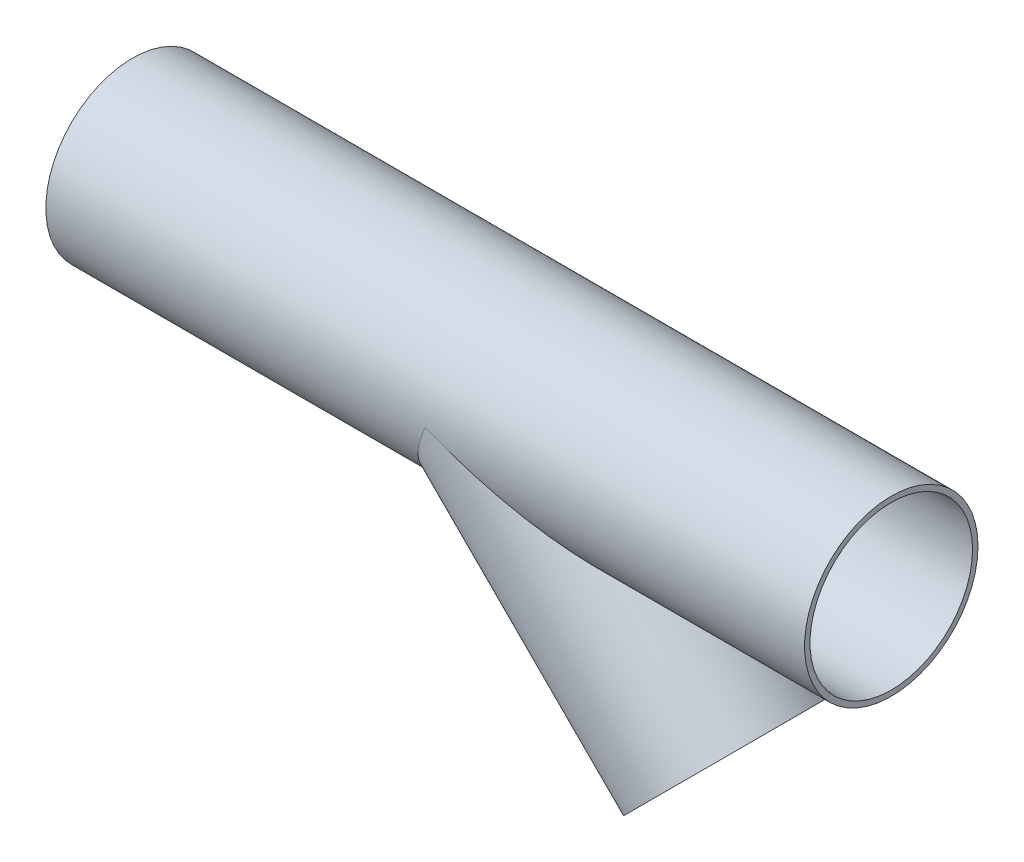
ISO-10303-21;
HEADER;
FILE_DESCRIPTION(('STEP AP214'),'2;1');
FILE_NAME('part.step','',(''),(''),'','','');
FILE_SCHEMA(('AUTOMOTIVE_DESIGN { 1 0 10303 214 1 1 1 1 }'));
ENDSEC;
DATA;
#1=APPLICATION_CONTEXT('core data for automotive mechanical design processes');
#2=APPLICATION_PROTOCOL_DEFINITION('international standard','automotive_design',2000,#1);
#3=PRODUCT_CONTEXT('',#1,'mechanical');
#4=PRODUCT('Part','Part','',(#3));
#5=PRODUCT_RELATED_PRODUCT_CATEGORY('part','',(#4));
#6=PRODUCT_DEFINITION_FORMATION('','',#4);
#7=PRODUCT_DEFINITION_CONTEXT('part definition',#1,'design');
#8=PRODUCT_DEFINITION('design','',#6,#7);
#9=PRODUCT_DEFINITION_SHAPE('','',#8);
#10=(LENGTH_UNIT() NAMED_UNIT(*) SI_UNIT(.MILLI.,.METRE.));
#11=(NAMED_UNIT(*) PLANE_ANGLE_UNIT() SI_UNIT($,.RADIAN.));
#12=(NAMED_UNIT(*) SI_UNIT($,.STERADIAN.) SOLID_ANGLE_UNIT());
#13=UNCERTAINTY_MEASURE_WITH_UNIT(LENGTH_MEASURE(1.E-05),#10,'distance_accuracy_value','');
#14=(GEOMETRIC_REPRESENTATION_CONTEXT(3) GLOBAL_UNCERTAINTY_ASSIGNED_CONTEXT((#13)) GLOBAL_UNIT_ASSIGNED_CONTEXT((#10,
#11,#12)) REPRESENTATION_CONTEXT('',''));
#15=CARTESIAN_POINT('',(0.,0.,0.));
#16=DIRECTION('',(0.,0.,1.));
#17=DIRECTION('',(1.,0.,0.));
#18=AXIS2_PLACEMENT_3D('',#15,#16,#17);
#19=CARTESIAN_POINT('',(250.,0.,-125.));
#20=DIRECTION('',(0.382683432365084,0.923879532511289,0.));
#21=DIRECTION('',(-0.923879532511289,0.382683432365084,0.));
#22=AXIS2_PLACEMENT_3D('',#19,#20,#21);
#23=PLANE('',#22);
#24=CARTESIAN_POINT('',(250.,0.,0.));
#25=DIRECTION('',(0.382683432365084,0.923879532511289,0.));
#26=DIRECTION('',(0.923879532511289,-0.382683432365084,0.));
#27=AXIS2_PLACEMENT_3D('',#24,#25,#26);
#28=ELLIPSE('',#27,140.978143910158,53.95);
#29=CARTESIAN_POINT('',(250.,0.,-53.95));
#30=VERTEX_POINT('',#29);
#31=CARTESIAN_POINT('',(250.,0.,53.95));
#32=VERTEX_POINT('',#31);
#33=EDGE_CURVE('E75',#30,#32,#28,.F.);
#34=ORIENTED_EDGE('',*,*,#33,.T.);
#35=DIRECTION('',(0.,0.,1.));
#36=VECTOR('',#35,1.);
#37=CARTESIAN_POINT('',(250.,0.,-125.));
#38=LINE('',#37,#36);
#39=CARTESIAN_POINT('',(250.,0.,57.15));
#40=VERTEX_POINT('',#39);
#41=EDGE_CURVE('E89',#32,#40,#38,.T.);
#42=ORIENTED_EDGE('',*,*,#41,.T.);
#43=CARTESIAN_POINT('',(250.,0.,0.));
#44=DIRECTION('',(0.382683432365084,0.923879532511289,0.));
#45=DIRECTION('',(0.923879532511289,-0.382683432365084,0.));
#46=AXIS2_PLACEMENT_3D('',#43,#44,#45);
#47=ELLIPSE('',#46,149.340146885367,57.15);
#48=CARTESIAN_POINT('',(250.,0.,-57.15));
#49=VERTEX_POINT('',#48);
#50=EDGE_CURVE('E85',#49,#40,#47,.F.);
#51=ORIENTED_EDGE('',*,*,#50,.F.);
#52=EDGE_CURVE('E62',#49,#30,#38,.T.);
#53=ORIENTED_EDGE('',*,*,#52,.T.);
#54=EDGE_LOOP('',(#34,#42,#51,#53));
#55=FACE_BOUND('',#54,.T.);
#56=ADVANCED_FACE('F58',(#55),#23,.T.);
#57=CARTESIAN_POINT('',(250.,0.,-125.));
#58=DIRECTION('',(-0.923879532511289,0.382683432365084,0.));
#59=DIRECTION('',(-0.382683432365084,-0.923879532511289,0.));
#60=AXIS2_PLACEMENT_3D('',#57,#58,#59);
#61=PLANE('',#60);
#62=CARTESIAN_POINT('',(250.,0.,0.));
#63=DIRECTION('',(-0.923879532511289,0.382683432365084,0.));
#64=DIRECTION('',(-0.382683432365084,-0.923879532511289,0.));
#65=AXIS2_PLACEMENT_3D('',#62,#63,#64);
#66=ELLIPSE('',#65,58.3950592057749,53.95);
#67=EDGE_CURVE('E96',#32,#30,#66,.F.);
#68=ORIENTED_EDGE('',*,*,#67,.T.);
#69=ORIENTED_EDGE('',*,*,#52,.F.);
#70=CARTESIAN_POINT('',(250.,0.,0.));
#71=DIRECTION('',(-0.923879532511289,0.382683432365084,0.));
#72=DIRECTION('',(-0.382683432365084,-0.923879532511289,0.));
#73=AXIS2_PLACEMENT_3D('',#70,#71,#72);
#74=ELLIPSE('',#73,61.8587142467106,57.15);
#75=EDGE_CURVE('E92',#40,#49,#74,.F.);
#76=ORIENTED_EDGE('',*,*,#75,.F.);
#77=ORIENTED_EDGE('',*,*,#41,.F.);
#78=EDGE_LOOP('',(#68,#69,#76,#77));
#79=FACE_BOUND('',#78,.T.);
#80=ADVANCED_FACE('F98',(#79),#61,.T.);
#81=CARTESIAN_POINT('',(393.542676580869,-143.542676580869,0.));
#82=DIRECTION('',(0.707106781186546,-0.707106781186549,0.));
#83=DIRECTION('',(0.707106781186549,0.707106781186546,0.));
#84=AXIS2_PLACEMENT_3D('',#81,#82,#83);
#85=PLANE('',#84);
#86=CARTESIAN_POINT('',(393.542676580869,-143.542676580869,0.));
#87=DIRECTION('',(0.707106781186546,-0.707106781186549,0.));
#88=DIRECTION('',(0.707106781186549,0.707106781186546,0.));
#89=AXIS2_PLACEMENT_3D('',#86,#87,#88);
#90=CIRCLE('',#89,53.95);
#91=CARTESIAN_POINT('',(431.691087425883,-105.394265735855,0.));
#92=VERTEX_POINT('',#91);
#93=EDGE_CURVE('E67',#92,#92,#90,.T.);
#94=ORIENTED_EDGE('',*,*,#93,.F.);
#95=EDGE_LOOP('',(#94));
#96=FACE_BOUND('',#95,.T.);
#97=CARTESIAN_POINT('',(393.542676580869,-143.542676580869,0.));
#98=DIRECTION('',(0.707106781186546,-0.707106781186549,0.));
#99=DIRECTION('',(0.707106781186549,0.707106781186546,0.));
#100=AXIS2_PLACEMENT_3D('',#97,#98,#99);
#101=CIRCLE('',#100,57.15);
#102=CARTESIAN_POINT('',(433.95382912568,-103.131524036058,0.));
#103=VERTEX_POINT('',#102);
#104=EDGE_CURVE('E13',#103,#103,#101,.T.);
#105=ORIENTED_EDGE('',*,*,#104,.T.);
#106=EDGE_LOOP('',(#105));
#107=FACE_BOUND('',#106,.T.);
#108=ADVANCED_FACE('F105',(#96,#107),#85,.T.);
#109=CARTESIAN_POINT('',(96.4235857864381,153.576414213562,0.));
#110=DIRECTION('',(0.707106781186546,-0.707106781186549,0.));
#111=DIRECTION('',(0.707106781186549,0.707106781186546,0.));
#112=AXIS2_PLACEMENT_3D('',#109,#110,#111);
#113=CYLINDRICAL_SURFACE('',#112,57.15);
#114=ORIENTED_EDGE('',*,*,#104,.F.);
#115=EDGE_LOOP('',(#114));
#116=FACE_BOUND('',#115,.T.);
#117=ORIENTED_EDGE('',*,*,#50,.T.);
#118=ORIENTED_EDGE('',*,*,#75,.T.);
#119=EDGE_LOOP('',(#117,#118));
#120=FACE_BOUND('',#119,.T.);
#121=ADVANCED_FACE('F94',(#116,#120),#113,.T.);
#122=CARTESIAN_POINT('',(96.4235857864381,153.576414213562,0.));
#123=DIRECTION('',(0.707106781186546,-0.707106781186549,0.));
#124=DIRECTION('',(0.707106781186549,0.707106781186546,0.));
#125=AXIS2_PLACEMENT_3D('',#122,#123,#124);
#126=CYLINDRICAL_SURFACE('',#125,53.95);
#127=ORIENTED_EDGE('',*,*,#93,.T.);
#128=EDGE_LOOP('',(#127));
#129=FACE_BOUND('',#128,.T.);
#130=ORIENTED_EDGE('',*,*,#67,.F.);
#131=ORIENTED_EDGE('',*,*,#33,.F.);
#132=EDGE_LOOP('',(#130,#131));
#133=FACE_BOUND('',#132,.T.);
#134=ADVANCED_FACE('F60',(#129,#133),#126,.F.);
#135=CLOSED_SHELL('',(#56,#80,#108,#121,#134));
#136=MANIFOLD_SOLID_BREP('B2',#135);
#137=CARTESIAN_POINT('',(500.,0.,0.));
#138=DIRECTION('',(-1.,0.,0.));
#139=DIRECTION('',(0.,0.,1.));
#140=AXIS2_PLACEMENT_3D('',#137,#138,#139);
#141=CYLINDRICAL_SURFACE('',#140,53.55);
#142=CARTESIAN_POINT('',(250.,0.,0.));
#143=DIRECTION('',(0.382683432365084,0.923879532511289,0.));
#144=DIRECTION('',(-0.923879532511289,0.382683432365084,0.));
#145=AXIS2_PLACEMENT_3D('',#142,#143,#144);
#146=ELLIPSE('',#145,139.932893538262,53.55);
#147=CARTESIAN_POINT('',(250.,0.,53.55));
#148=VERTEX_POINT('',#147);
#149=CARTESIAN_POINT('',(250.,0.,-53.55));
#150=VERTEX_POINT('',#149);
#151=EDGE_CURVE('E181',#148,#150,#146,.T.);
#152=ORIENTED_EDGE('',*,*,#151,.F.);
#153=CARTESIAN_POINT('',(250.,0.,0.));
#154=DIRECTION('',(-0.923879532511289,0.382683432365084,0.));
#155=DIRECTION('',(-0.382683432365084,-0.923879532511289,0.));
#156=AXIS2_PLACEMENT_3D('',#153,#154,#155);
#157=ELLIPSE('',#156,57.9621023256576,53.55);
#158=EDGE_CURVE('E183',#150,#148,#157,.T.);
#159=ORIENTED_EDGE('',*,*,#158,.F.);
#160=EDGE_LOOP('',(#152,#159));
#161=FACE_BOUND('',#160,.T.);
#162=CARTESIAN_POINT('',(500.,0.,0.));
#163=DIRECTION('',(1.,0.,0.));
#164=DIRECTION('',(0.,0.,-1.));
#165=AXIS2_PLACEMENT_3D('',#162,#163,#164);
#166=CIRCLE('',#165,53.55);
#167=CARTESIAN_POINT('',(500.,0.,-53.55));
#168=VERTEX_POINT('',#167);
#169=EDGE_CURVE('E196',#168,#168,#166,.T.);
#170=ORIENTED_EDGE('',*,*,#169,.T.);
#171=EDGE_LOOP('',(#170));
#172=FACE_BOUND('',#171,.T.);
#173=CARTESIAN_POINT('',(0.,0.,0.));
#174=DIRECTION('',(1.,0.,0.));
#175=DIRECTION('',(0.,0.,-1.));
#176=AXIS2_PLACEMENT_3D('',#173,#174,#175);
#177=CIRCLE('',#176,53.55);
#178=CARTESIAN_POINT('',(0.,0.,-53.55));
#179=VERTEX_POINT('',#178);
#180=EDGE_CURVE('E197',#179,#179,#177,.T.);
#181=ORIENTED_EDGE('',*,*,#180,.F.);
#182=EDGE_LOOP('',(#181));
#183=FACE_BOUND('',#182,.T.);
#184=ADVANCED_FACE('F150',(#161,#172,#183),#141,.F.);
#185=CARTESIAN_POINT('',(500.,0.,0.));
#186=DIRECTION('',(-1.,0.,0.));
#187=DIRECTION('',(0.,0.,1.));
#188=AXIS2_PLACEMENT_3D('',#185,#186,#187);
#189=CYLINDRICAL_SURFACE('',#188,57.15);
#190=CARTESIAN_POINT('',(250.,0.,0.));
#191=DIRECTION('',(-0.923879532511289,0.382683432365084,0.));
#192=DIRECTION('',(-0.382683432365084,-0.923879532511289,0.));
#193=AXIS2_PLACEMENT_3D('',#190,#191,#192);
#194=ELLIPSE('',#193,61.8587142467102,57.15);
#195=CARTESIAN_POINT('',(250.,0.,-57.15));
#196=VERTEX_POINT('',#195);
#197=CARTESIAN_POINT('',(250.,0.,57.15));
#198=VERTEX_POINT('',#197);
#199=EDGE_CURVE('E157',#196,#198,#194,.T.);
#200=ORIENTED_EDGE('',*,*,#199,.T.);
#201=CARTESIAN_POINT('',(250.,0.,0.));
#202=DIRECTION('',(0.382683432365084,0.923879532511289,0.));
#203=DIRECTION('',(-0.923879532511289,0.382683432365084,0.));
#204=AXIS2_PLACEMENT_3D('',#201,#202,#203);
#205=ELLIPSE('',#204,149.340146885372,57.15);
#206=EDGE_CURVE('E56',#198,#196,#205,.T.);
#207=ORIENTED_EDGE('',*,*,#206,.T.);
#208=EDGE_LOOP('',(#200,#207));
#209=FACE_BOUND('',#208,.T.);
#210=CARTESIAN_POINT('',(500.,0.,0.));
#211=DIRECTION('',(1.,0.,0.));
#212=DIRECTION('',(0.,0.,-1.));
#213=AXIS2_PLACEMENT_3D('',#210,#211,#212);
#214=CIRCLE('',#213,57.15);
#215=CARTESIAN_POINT('',(500.,0.,-57.15));
#216=VERTEX_POINT('',#215);
#217=EDGE_CURVE('E178',#216,#216,#214,.T.);
#218=ORIENTED_EDGE('',*,*,#217,.F.);
#219=EDGE_LOOP('',(#218));
#220=FACE_BOUND('',#219,.T.);
#221=CARTESIAN_POINT('',(0.,0.,0.));
#222=DIRECTION('',(1.,0.,0.));
#223=DIRECTION('',(0.,0.,-1.));
#224=AXIS2_PLACEMENT_3D('',#221,#222,#223);
#225=CIRCLE('',#224,57.15);
#226=CARTESIAN_POINT('',(0.,0.,-57.15));
#227=VERTEX_POINT('',#226);
#228=EDGE_CURVE('E194',#227,#227,#225,.T.);
#229=ORIENTED_EDGE('',*,*,#228,.T.);
#230=EDGE_LOOP('',(#229));
#231=FACE_BOUND('',#230,.T.);
#232=ADVANCED_FACE('F185',(#209,#220,#231),#189,.T.);
#233=CARTESIAN_POINT('',(500.,0.,0.));
#234=DIRECTION('',(1.,0.,0.));
#235=DIRECTION('',(0.,0.,-1.));
#236=AXIS2_PLACEMENT_3D('',#233,#234,#235);
#237=PLANE('',#236);
#238=ORIENTED_EDGE('',*,*,#169,.F.);
#239=EDGE_LOOP('',(#238));
#240=FACE_BOUND('',#239,.T.);
#241=ORIENTED_EDGE('',*,*,#217,.T.);
#242=EDGE_LOOP('',(#241));
#243=FACE_BOUND('',#242,.T.);
#244=ADVANCED_FACE('F188',(#240,#243),#237,.T.);
#245=CARTESIAN_POINT('',(0.,0.,0.));
#246=DIRECTION('',(1.,0.,0.));
#247=DIRECTION('',(0.,0.,-1.));
#248=AXIS2_PLACEMENT_3D('',#245,#246,#247);
#249=PLANE('',#248);
#250=ORIENTED_EDGE('',*,*,#180,.T.);
#251=EDGE_LOOP('',(#250));
#252=FACE_BOUND('',#251,.T.);
#253=ORIENTED_EDGE('',*,*,#228,.F.);
#254=EDGE_LOOP('',(#253));
#255=FACE_BOUND('',#254,.T.);
#256=ADVANCED_FACE('F213',(#252,#255),#249,.F.);
#257=CARTESIAN_POINT('',(250.,0.,-125.));
#258=DIRECTION('',(0.382683432365084,0.923879532511289,0.));
#259=DIRECTION('',(-0.923879532511289,0.382683432365084,0.));
#260=AXIS2_PLACEMENT_3D('',#257,#258,#259);
#261=PLANE('',#260);
#262=ORIENTED_EDGE('',*,*,#151,.T.);
#263=DIRECTION('',(0.,0.,1.));
#264=VECTOR('',#263,1.);
#265=CARTESIAN_POINT('',(250.,0.,-125.));
#266=LINE('',#265,#264);
#267=EDGE_CURVE('E164',#196,#150,#266,.T.);
#268=ORIENTED_EDGE('',*,*,#267,.F.);
#269=ORIENTED_EDGE('',*,*,#206,.F.);
#270=EDGE_CURVE('E176',#148,#198,#266,.T.);
#271=ORIENTED_EDGE('',*,*,#270,.F.);
#272=EDGE_LOOP('',(#262,#268,#269,#271));
#273=FACE_BOUND('',#272,.T.);
#274=ADVANCED_FACE('F179',(#273),#261,.F.);
#275=CARTESIAN_POINT('',(250.,0.,-125.));
#276=DIRECTION('',(-0.923879532511289,0.382683432365084,0.));
#277=DIRECTION('',(-0.382683432365084,-0.923879532511289,0.));
#278=AXIS2_PLACEMENT_3D('',#275,#276,#277);
#279=PLANE('',#278);
#280=ORIENTED_EDGE('',*,*,#158,.T.);
#281=ORIENTED_EDGE('',*,*,#270,.T.);
#282=ORIENTED_EDGE('',*,*,#199,.F.);
#283=ORIENTED_EDGE('',*,*,#267,.T.);
#284=EDGE_LOOP('',(#280,#281,#282,#283));
#285=FACE_BOUND('',#284,.T.);
#286=ADVANCED_FACE('F175',(#285),#279,.F.);
#287=CLOSED_SHELL('',(#184,#232,#244,#256,#274,#286));
#288=MANIFOLD_SOLID_BREP('B7',#287);
#289=ADVANCED_BREP_SHAPE_REPRESENTATION('',(#18,#136,#288),#14);
#290=SHAPE_DEFINITION_REPRESENTATION(#9,#289);
ENDSEC;
END-ISO-10303-21;
